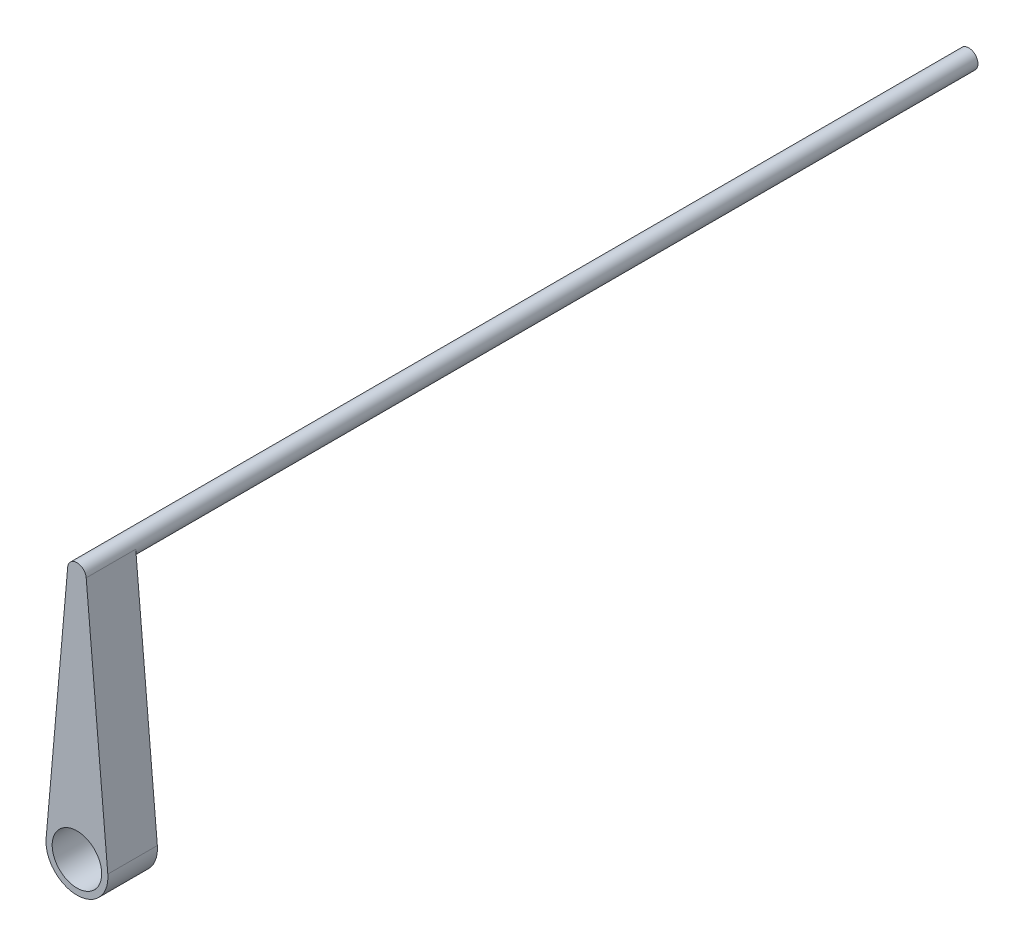
ISO-10303-21;
HEADER;
FILE_DESCRIPTION(('STEP AP214'),'2;1');
FILE_NAME('part.step','',(''),(''),'','','');
FILE_SCHEMA(('AUTOMOTIVE_DESIGN { 1 0 10303 214 1 1 1 1 }'));
ENDSEC;
DATA;
#1=APPLICATION_CONTEXT('core data for automotive mechanical design processes');
#2=APPLICATION_PROTOCOL_DEFINITION('international standard','automotive_design',2000,#1);
#3=PRODUCT_CONTEXT('',#1,'mechanical');
#4=PRODUCT('Part','Part','',(#3));
#5=PRODUCT_RELATED_PRODUCT_CATEGORY('part','',(#4));
#6=PRODUCT_DEFINITION_FORMATION('','',#4);
#7=PRODUCT_DEFINITION_CONTEXT('part definition',#1,'design');
#8=PRODUCT_DEFINITION('design','',#6,#7);
#9=PRODUCT_DEFINITION_SHAPE('','',#8);
#10=(LENGTH_UNIT() NAMED_UNIT(*) SI_UNIT(.MILLI.,.METRE.));
#11=(NAMED_UNIT(*) PLANE_ANGLE_UNIT() SI_UNIT($,.RADIAN.));
#12=(NAMED_UNIT(*) SI_UNIT($,.STERADIAN.) SOLID_ANGLE_UNIT());
#13=UNCERTAINTY_MEASURE_WITH_UNIT(LENGTH_MEASURE(1.E-05),#10,'distance_accuracy_value','');
#14=(GEOMETRIC_REPRESENTATION_CONTEXT(3) GLOBAL_UNCERTAINTY_ASSIGNED_CONTEXT((#13)) GLOBAL_UNIT_ASSIGNED_CONTEXT((#10,
#11,#12)) REPRESENTATION_CONTEXT('',''));
#15=CARTESIAN_POINT('',(0.,0.,0.));
#16=DIRECTION('',(0.,0.,1.));
#17=DIRECTION('',(1.,0.,0.));
#18=AXIS2_PLACEMENT_3D('',#15,#16,#17);
#19=CARTESIAN_POINT('',(0.,0.,4.));
#20=DIRECTION('',(0.,0.,-1.));
#21=DIRECTION('',(-1.,0.,0.));
#22=AXIS2_PLACEMENT_3D('',#19,#20,#21);
#23=CYLINDRICAL_SURFACE('',#22,2.5);
#24=CARTESIAN_POINT('',(0.,0.,0.));
#25=DIRECTION('',(0.,0.,1.));
#26=DIRECTION('',(1.,0.,0.));
#27=AXIS2_PLACEMENT_3D('',#24,#25,#26);
#28=CIRCLE('',#27,2.5);
#29=CARTESIAN_POINT('',(-2.4904112988621,0.21875,0.));
#30=VERTEX_POINT('',#29);
#31=CARTESIAN_POINT('',(2.4904112988621,0.21875,0.));
#32=VERTEX_POINT('',#31);
#33=EDGE_CURVE('E83',#30,#32,#28,.T.);
#34=ORIENTED_EDGE('',*,*,#33,.T.);
#35=DIRECTION('',(0.,0.,-1.));
#36=VECTOR('',#35,1.);
#37=CARTESIAN_POINT('',(2.4904112988621,0.21875,4.));
#38=LINE('',#37,#36);
#39=CARTESIAN_POINT('',(2.4904112988621,0.21875,4.));
#40=VERTEX_POINT('',#39);
#41=EDGE_CURVE('E11',#40,#32,#38,.T.);
#42=ORIENTED_EDGE('',*,*,#41,.F.);
#43=CARTESIAN_POINT('',(0.,0.,4.));
#44=DIRECTION('',(0.,0.,1.));
#45=DIRECTION('',(1.,0.,0.));
#46=AXIS2_PLACEMENT_3D('',#43,#44,#45);
#47=CIRCLE('',#46,2.5);
#48=CARTESIAN_POINT('',(-2.4904112988621,0.21875,4.));
#49=VERTEX_POINT('',#48);
#50=EDGE_CURVE('E85',#49,#40,#47,.T.);
#51=ORIENTED_EDGE('',*,*,#50,.F.);
#52=DIRECTION('',(0.,0.,-1.));
#53=VECTOR('',#52,1.);
#54=CARTESIAN_POINT('',(-2.4904112988621,0.21875,4.));
#55=LINE('',#54,#53);
#56=EDGE_CURVE('E63',#49,#30,#55,.T.);
#57=ORIENTED_EDGE('',*,*,#56,.T.);
#58=EDGE_LOOP('',(#34,#42,#51,#57));
#59=FACE_BOUND('',#58,.T.);
#60=ADVANCED_FACE('F45',(#59),#23,.T.);
#61=CARTESIAN_POINT('',(2.4904112988621,0.21875,4.));
#62=DIRECTION('',(-0.996164519544839,-0.0875,0.));
#63=DIRECTION('',(0.0875,-0.996164519544839,0.));
#64=AXIS2_PLACEMENT_3D('',#61,#62,#63);
#65=PLANE('',#64);
#66=DIRECTION('',(-0.0875,0.996164519544839,0.));
#67=VECTOR('',#66,1.);
#68=CARTESIAN_POINT('',(2.4904112988621,0.21875,0.));
#69=LINE('',#68,#67);
#70=CARTESIAN_POINT('',(0.747123389658629,20.065625,0.));
#71=VERTEX_POINT('',#70);
#72=EDGE_CURVE('E96',#32,#71,#69,.T.);
#73=ORIENTED_EDGE('',*,*,#72,.T.);
#74=DIRECTION('',(0.,0.,-1.));
#75=VECTOR('',#74,1.);
#76=CARTESIAN_POINT('',(0.747123389658629,20.065625,4.));
#77=LINE('',#76,#75);
#78=CARTESIAN_POINT('',(0.747123389658629,20.065625,4.));
#79=VERTEX_POINT('',#78);
#80=EDGE_CURVE('E55',#79,#71,#77,.T.);
#81=ORIENTED_EDGE('',*,*,#80,.F.);
#82=DIRECTION('',(-0.0875,0.996164519544839,0.));
#83=VECTOR('',#82,1.);
#84=CARTESIAN_POINT('',(2.4904112988621,0.21875,4.));
#85=LINE('',#84,#83);
#86=EDGE_CURVE('E118',#40,#79,#85,.T.);
#87=ORIENTED_EDGE('',*,*,#86,.F.);
#88=ORIENTED_EDGE('',*,*,#41,.T.);
#89=EDGE_LOOP('',(#73,#81,#87,#88));
#90=FACE_BOUND('',#89,.T.);
#91=ADVANCED_FACE('F132',(#90),#65,.F.);
#92=CARTESIAN_POINT('',(0.,0.,4.));
#93=DIRECTION('',(0.,0.,-1.));
#94=DIRECTION('',(-1.,0.,0.));
#95=AXIS2_PLACEMENT_3D('',#92,#93,#94);
#96=CYLINDRICAL_SURFACE('',#95,2.);
#97=CARTESIAN_POINT('',(0.,0.,4.));
#98=DIRECTION('',(0.,0.,1.));
#99=DIRECTION('',(1.,0.,0.));
#100=AXIS2_PLACEMENT_3D('',#97,#98,#99);
#101=CIRCLE('',#100,2.);
#102=CARTESIAN_POINT('',(2.,0.,4.));
#103=VERTEX_POINT('',#102);
#104=EDGE_CURVE('E104',#103,#103,#101,.T.);
#105=ORIENTED_EDGE('',*,*,#104,.T.);
#106=EDGE_LOOP('',(#105));
#107=FACE_BOUND('',#106,.T.);
#108=CARTESIAN_POINT('',(0.,0.,0.));
#109=DIRECTION('',(0.,0.,1.));
#110=DIRECTION('',(1.,0.,0.));
#111=AXIS2_PLACEMENT_3D('',#108,#109,#110);
#112=CIRCLE('',#111,2.);
#113=CARTESIAN_POINT('',(2.,0.,0.));
#114=VERTEX_POINT('',#113);
#115=EDGE_CURVE('E98',#114,#114,#112,.T.);
#116=ORIENTED_EDGE('',*,*,#115,.F.);
#117=EDGE_LOOP('',(#116));
#118=FACE_BOUND('',#117,.T.);
#119=ADVANCED_FACE('F47',(#107,#118),#96,.F.);
#120=CARTESIAN_POINT('',(-2.4904112988621,0.21875,4.));
#121=DIRECTION('',(-0.996164519544839,0.0875,0.));
#122=DIRECTION('',(-0.0875,-0.996164519544839,0.));
#123=AXIS2_PLACEMENT_3D('',#120,#121,#122);
#124=PLANE('',#123);
#125=DIRECTION('',(0.0875,0.996164519544839,0.));
#126=VECTOR('',#125,1.);
#127=CARTESIAN_POINT('',(-2.4904112988621,0.21875,0.));
#128=LINE('',#127,#126);
#129=CARTESIAN_POINT('',(-0.747123389658629,20.065625,0.));
#130=VERTEX_POINT('',#129);
#131=EDGE_CURVE('E95',#30,#130,#128,.T.);
#132=ORIENTED_EDGE('',*,*,#131,.F.);
#133=ORIENTED_EDGE('',*,*,#56,.F.);
#134=DIRECTION('',(0.0875,0.996164519544839,0.));
#135=VECTOR('',#134,1.);
#136=CARTESIAN_POINT('',(-2.4904112988621,0.21875,4.));
#137=LINE('',#136,#135);
#138=CARTESIAN_POINT('',(-0.747123389658629,20.065625,4.));
#139=VERTEX_POINT('',#138);
#140=EDGE_CURVE('E89',#49,#139,#137,.T.);
#141=ORIENTED_EDGE('',*,*,#140,.T.);
#142=DIRECTION('',(0.,0.,-1.));
#143=VECTOR('',#142,1.);
#144=CARTESIAN_POINT('',(-0.747123389658629,20.065625,4.));
#145=LINE('',#144,#143);
#146=EDGE_CURVE('E88',#139,#130,#145,.T.);
#147=ORIENTED_EDGE('',*,*,#146,.T.);
#148=EDGE_LOOP('',(#132,#133,#141,#147));
#149=FACE_BOUND('',#148,.T.);
#150=ADVANCED_FACE('F101',(#149),#124,.T.);
#151=CARTESIAN_POINT('',(0.,0.,4.));
#152=DIRECTION('',(0.,0.,1.));
#153=DIRECTION('',(1.,0.,0.));
#154=AXIS2_PLACEMENT_3D('',#151,#152,#153);
#155=PLANE('',#154);
#156=ORIENTED_EDGE('',*,*,#104,.F.);
#157=EDGE_LOOP('',(#156));
#158=FACE_BOUND('',#157,.T.);
#159=ORIENTED_EDGE('',*,*,#50,.T.);
#160=ORIENTED_EDGE('',*,*,#86,.T.);
#161=CARTESIAN_POINT('',(0.,20.,4.));
#162=DIRECTION('',(0.,0.,1.));
#163=DIRECTION('',(1.,0.,0.));
#164=AXIS2_PLACEMENT_3D('',#161,#162,#163);
#165=CIRCLE('',#164,0.75);
#166=EDGE_CURVE('E139',#79,#139,#165,.T.);
#167=ORIENTED_EDGE('',*,*,#166,.T.);
#168=ORIENTED_EDGE('',*,*,#140,.F.);
#169=EDGE_LOOP('',(#159,#160,#167,#168));
#170=FACE_BOUND('',#169,.T.);
#171=ADVANCED_FACE('F142',(#158,#170),#155,.T.);
#172=CARTESIAN_POINT('',(0.,0.,0.));
#173=DIRECTION('',(0.,0.,1.));
#174=DIRECTION('',(1.,0.,0.));
#175=AXIS2_PLACEMENT_3D('',#172,#173,#174);
#176=PLANE('',#175);
#177=ORIENTED_EDGE('',*,*,#115,.T.);
#178=EDGE_LOOP('',(#177));
#179=FACE_BOUND('',#178,.T.);
#180=ORIENTED_EDGE('',*,*,#33,.F.);
#181=ORIENTED_EDGE('',*,*,#131,.T.);
#182=CARTESIAN_POINT('',(0.,20.,0.));
#183=DIRECTION('',(0.,0.,1.));
#184=DIRECTION('',(1.,0.,0.));
#185=AXIS2_PLACEMENT_3D('',#182,#183,#184);
#186=CIRCLE('',#185,0.75);
#187=EDGE_CURVE('E105',#130,#71,#186,.T.);
#188=ORIENTED_EDGE('',*,*,#187,.T.);
#189=ORIENTED_EDGE('',*,*,#72,.F.);
#190=EDGE_LOOP('',(#180,#181,#188,#189));
#191=FACE_BOUND('',#190,.T.);
#192=ADVANCED_FACE('F93',(#179,#191),#176,.F.);
#193=CARTESIAN_POINT('',(0.,20.,-68.));
#194=DIRECTION('',(0.,0.,1.));
#195=DIRECTION('',(1.,0.,0.));
#196=AXIS2_PLACEMENT_3D('',#193,#194,#195);
#197=CYLINDRICAL_SURFACE('',#196,0.75);
#198=CARTESIAN_POINT('',(0.,20.,-68.));
#199=DIRECTION('',(0.,0.,1.));
#200=DIRECTION('',(1.,0.,0.));
#201=AXIS2_PLACEMENT_3D('',#198,#199,#200);
#202=CIRCLE('',#201,0.75);
#203=CARTESIAN_POINT('',(0.75,20.,-68.));
#204=VERTEX_POINT('',#203);
#205=EDGE_CURVE('E129',#204,#204,#202,.T.);
#206=ORIENTED_EDGE('',*,*,#205,.T.);
#207=EDGE_LOOP('',(#206));
#208=FACE_BOUND('',#207,.T.);
#209=ORIENTED_EDGE('',*,*,#80,.T.);
#210=ORIENTED_EDGE('',*,*,#187,.F.);
#211=ORIENTED_EDGE('',*,*,#146,.F.);
#212=ORIENTED_EDGE('',*,*,#166,.F.);
#213=EDGE_LOOP('',(#209,#210,#211,#212));
#214=FACE_BOUND('',#213,.T.);
#215=ADVANCED_FACE('F134',(#208,#214),#197,.T.);
#216=CARTESIAN_POINT('',(0.,0.,-68.));
#217=DIRECTION('',(0.,0.,1.));
#218=DIRECTION('',(1.,0.,0.));
#219=AXIS2_PLACEMENT_3D('',#216,#217,#218);
#220=PLANE('',#219);
#221=ORIENTED_EDGE('',*,*,#205,.F.);
#222=EDGE_LOOP('',(#221));
#223=FACE_BOUND('',#222,.T.);
#224=ADVANCED_FACE('F197',(#223),#220,.F.);
#225=CLOSED_SHELL('',(#60,#91,#119,#150,#171,#192,#215,#224));
#226=MANIFOLD_SOLID_BREP('B2',#225);
#227=ADVANCED_BREP_SHAPE_REPRESENTATION('',(#18,#226),#14);
#228=SHAPE_DEFINITION_REPRESENTATION(#9,#227);
ENDSEC;
END-ISO-10303-21;
